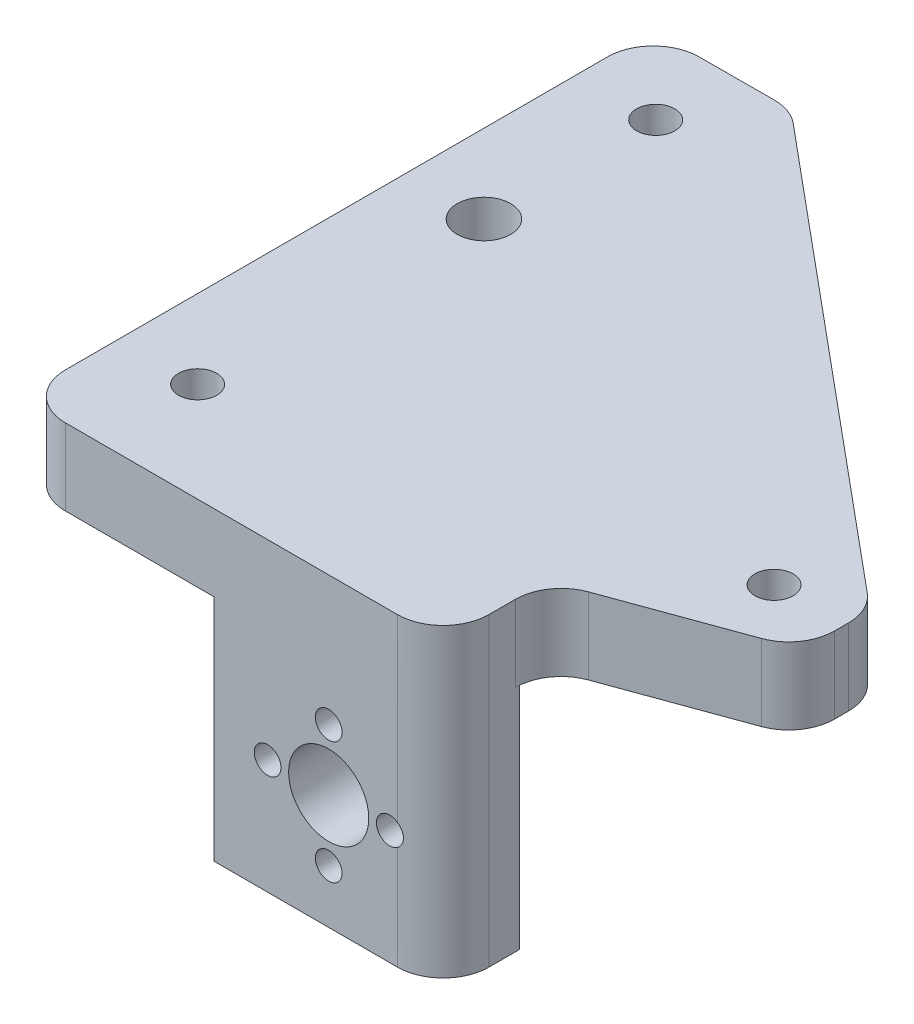
ISO-10303-21;
HEADER;
FILE_DESCRIPTION(('STEP AP214'),'2;1');
FILE_NAME('part.step','',(''),(''),'','','');
FILE_SCHEMA(('AUTOMOTIVE_DESIGN { 1 0 10303 214 1 1 1 1 }'));
ENDSEC;
DATA;
#1=APPLICATION_CONTEXT('core data for automotive mechanical design processes');
#2=APPLICATION_PROTOCOL_DEFINITION('international standard','automotive_design',2000,#1);
#3=PRODUCT_CONTEXT('',#1,'mechanical');
#4=PRODUCT('Part','Part','',(#3));
#5=PRODUCT_RELATED_PRODUCT_CATEGORY('part','',(#4));
#6=PRODUCT_DEFINITION_FORMATION('','',#4);
#7=PRODUCT_DEFINITION_CONTEXT('part definition',#1,'design');
#8=PRODUCT_DEFINITION('design','',#6,#7);
#9=PRODUCT_DEFINITION_SHAPE('','',#8);
#10=(LENGTH_UNIT() NAMED_UNIT(*) SI_UNIT(.MILLI.,.METRE.));
#11=(NAMED_UNIT(*) PLANE_ANGLE_UNIT() SI_UNIT($,.RADIAN.));
#12=(NAMED_UNIT(*) SI_UNIT($,.STERADIAN.) SOLID_ANGLE_UNIT());
#13=UNCERTAINTY_MEASURE_WITH_UNIT(LENGTH_MEASURE(1.E-05),#10,'distance_accuracy_value','');
#14=(GEOMETRIC_REPRESENTATION_CONTEXT(3) GLOBAL_UNCERTAINTY_ASSIGNED_CONTEXT((#13)) GLOBAL_UNIT_ASSIGNED_CONTEXT((#10,
#11,#12)) REPRESENTATION_CONTEXT('',''));
#15=CARTESIAN_POINT('',(0.,0.,0.));
#16=DIRECTION('',(0.,0.,1.));
#17=DIRECTION('',(1.,0.,0.));
#18=AXIS2_PLACEMENT_3D('',#15,#16,#17);
#19=CARTESIAN_POINT('',(25.5,10.,0.));
#20=DIRECTION('',(0.,0.,-1.));
#21=DIRECTION('',(-1.,0.,0.));
#22=AXIS2_PLACEMENT_3D('',#19,#20,#21);
#23=PLANE('',#22);
#24=CARTESIAN_POINT('',(32.5,-15.,0.));
#25=DIRECTION('',(0.,0.,1.));
#26=DIRECTION('',(1.,0.,0.));
#27=AXIS2_PLACEMENT_3D('',#24,#25,#26);
#28=CIRCLE('',#27,1.75);
#29=CARTESIAN_POINT('',(34.25,-15.,0.));
#30=VERTEX_POINT('',#29);
#31=EDGE_CURVE('E163',#30,#30,#28,.T.);
#32=ORIENTED_EDGE('',*,*,#31,.F.);
#33=EDGE_LOOP('',(#32));
#34=FACE_BOUND('',#33,.T.);
#35=CARTESIAN_POINT('',(40.5,-7.,0.));
#36=DIRECTION('',(0.,0.,-1.));
#37=DIRECTION('',(-1.,0.,0.));
#38=AXIS2_PLACEMENT_3D('',#35,#36,#37);
#39=CIRCLE('',#38,1.75);
#40=CARTESIAN_POINT('',(38.75,-7.,0.));
#41=VERTEX_POINT('',#40);
#42=EDGE_CURVE('E479',#41,#41,#39,.T.);
#43=ORIENTED_EDGE('',*,*,#42,.T.);
#44=EDGE_LOOP('',(#43));
#45=FACE_BOUND('',#44,.T.);
#46=CARTESIAN_POINT('',(40.5,-23.,0.));
#47=DIRECTION('',(0.,0.,1.));
#48=DIRECTION('',(1.,0.,0.));
#49=AXIS2_PLACEMENT_3D('',#46,#47,#48);
#50=CIRCLE('',#49,1.75);
#51=CARTESIAN_POINT('',(42.25,-23.,0.));
#52=VERTEX_POINT('',#51);
#53=EDGE_CURVE('E492',#52,#52,#50,.T.);
#54=ORIENTED_EDGE('',*,*,#53,.F.);
#55=EDGE_LOOP('',(#54));
#56=FACE_BOUND('',#55,.T.);
#57=DIRECTION('',(0.,-1.,0.));
#58=VECTOR('',#57,1.);
#59=CARTESIAN_POINT('',(49.5,10.,0.));
#60=LINE('',#59,#58);
#61=CARTESIAN_POINT('',(49.5,-16.4361406616345,0.));
#62=VERTEX_POINT('',#61);
#63=CARTESIAN_POINT('',(49.5,-30.,0.));
#64=VERTEX_POINT('',#63);
#65=EDGE_CURVE('E172',#62,#64,#60,.T.);
#66=ORIENTED_EDGE('',*,*,#65,.F.);
#67=CARTESIAN_POINT('',(48.5,-15.,0.));
#68=DIRECTION('',(0.,0.,-1.));
#69=DIRECTION('',(-1.,0.,0.));
#70=AXIS2_PLACEMENT_3D('',#67,#68,#69);
#71=CIRCLE('',#70,1.75);
#72=CARTESIAN_POINT('',(49.5,-13.5638593383655,0.));
#73=VERTEX_POINT('',#72);
#74=EDGE_CURVE('E48',#62,#73,#71,.T.);
#75=ORIENTED_EDGE('',*,*,#74,.T.);
#76=CARTESIAN_POINT('',(49.5,10.,0.));
#77=VERTEX_POINT('',#76);
#78=EDGE_CURVE('E169',#77,#73,#60,.T.);
#79=ORIENTED_EDGE('',*,*,#78,.F.);
#80=DIRECTION('',(1.,0.,0.));
#81=VECTOR('',#80,1.);
#82=CARTESIAN_POINT('',(6.00000000000004,10.,0.));
#83=LINE('',#82,#81);
#84=CARTESIAN_POINT('',(6.,10.,0.));
#85=VERTEX_POINT('',#84);
#86=EDGE_CURVE('E338',#85,#77,#83,.T.);
#87=ORIENTED_EDGE('',*,*,#86,.F.);
#88=DIRECTION('',(0.,-1.,0.));
#89=VECTOR('',#88,1.);
#90=CARTESIAN_POINT('',(6.,10.,0.));
#91=LINE('',#90,#89);
#92=CARTESIAN_POINT('',(6.,0.,0.));
#93=VERTEX_POINT('',#92);
#94=EDGE_CURVE('E179',#85,#93,#91,.T.);
#95=ORIENTED_EDGE('',*,*,#94,.T.);
#96=DIRECTION('',(1.,0.,0.));
#97=VECTOR('',#96,1.);
#98=CARTESIAN_POINT('',(25.5,0.,0.));
#99=LINE('',#98,#97);
#100=CARTESIAN_POINT('',(25.5,0.,0.));
#101=VERTEX_POINT('',#100);
#102=EDGE_CURVE('E252',#93,#101,#99,.T.);
#103=ORIENTED_EDGE('',*,*,#102,.T.);
#104=DIRECTION('',(0.,1.,0.));
#105=VECTOR('',#104,1.);
#106=CARTESIAN_POINT('',(25.5,-30.,0.));
#107=LINE('',#106,#105);
#108=CARTESIAN_POINT('',(25.5,-30.,0.));
#109=VERTEX_POINT('',#108);
#110=EDGE_CURVE('E56',#109,#101,#107,.T.);
#111=ORIENTED_EDGE('',*,*,#110,.F.);
#112=DIRECTION('',(1.,0.,0.));
#113=VECTOR('',#112,1.);
#114=CARTESIAN_POINT('',(74.,-30.,0.));
#115=LINE('',#114,#113);
#116=EDGE_CURVE('E281',#109,#64,#115,.T.);
#117=ORIENTED_EDGE('',*,*,#116,.T.);
#118=EDGE_LOOP('',(#66,#75,#79,#87,#95,#103,#111,#117));
#119=FACE_BOUND('',#118,.T.);
#120=CARTESIAN_POINT('',(40.5,-15.,0.));
#121=DIRECTION('',(0.,0.,-1.));
#122=DIRECTION('',(-1.,0.,0.));
#123=AXIS2_PLACEMENT_3D('',#120,#121,#122);
#124=CIRCLE('',#123,5.25);
#125=CARTESIAN_POINT('',(35.25,-15.,0.));
#126=VERTEX_POINT('',#125);
#127=EDGE_CURVE('E480',#126,#126,#124,.T.);
#128=ORIENTED_EDGE('',*,*,#127,.T.);
#129=EDGE_LOOP('',(#128));
#130=FACE_BOUND('',#129,.T.);
#131=ADVANCED_FACE('F33',(#34,#45,#56,#119,#130),#23,.F.);
#132=CARTESIAN_POINT('',(74.,-30.,-10.));
#133=DIRECTION('',(0.,0.,-1.));
#134=DIRECTION('',(-1.,0.,0.));
#135=AXIS2_PLACEMENT_3D('',#132,#133,#134);
#136=PLANE('',#135);
#137=CARTESIAN_POINT('',(32.5,-15.,-10.));
#138=DIRECTION('',(0.,0.,1.));
#139=DIRECTION('',(1.,0.,0.));
#140=AXIS2_PLACEMENT_3D('',#137,#138,#139);
#141=CIRCLE('',#140,1.75);
#142=CARTESIAN_POINT('',(34.25,-15.,-10.));
#143=VERTEX_POINT('',#142);
#144=EDGE_CURVE('E491',#143,#143,#141,.T.);
#145=ORIENTED_EDGE('',*,*,#144,.T.);
#146=EDGE_LOOP('',(#145));
#147=FACE_BOUND('',#146,.T.);
#148=CARTESIAN_POINT('',(40.5,-23.,-10.));
#149=DIRECTION('',(0.,0.,1.));
#150=DIRECTION('',(1.,0.,0.));
#151=AXIS2_PLACEMENT_3D('',#148,#149,#150);
#152=CIRCLE('',#151,1.75);
#153=CARTESIAN_POINT('',(42.25,-23.,-10.));
#154=VERTEX_POINT('',#153);
#155=EDGE_CURVE('E488',#154,#154,#152,.T.);
#156=ORIENTED_EDGE('',*,*,#155,.T.);
#157=EDGE_LOOP('',(#156));
#158=FACE_BOUND('',#157,.T.);
#159=DIRECTION('',(-1.,0.,0.));
#160=VECTOR('',#159,1.);
#161=CARTESIAN_POINT('',(74.,0.,-10.));
#162=LINE('',#161,#160);
#163=CARTESIAN_POINT('',(55.5,0.,-10.));
#164=VERTEX_POINT('',#163);
#165=CARTESIAN_POINT('',(25.5,0.,-10.));
#166=VERTEX_POINT('',#165);
#167=EDGE_CURVE('E282',#164,#166,#162,.T.);
#168=ORIENTED_EDGE('',*,*,#167,.F.);
#169=DIRECTION('',(0.,1.,0.));
#170=VECTOR('',#169,1.);
#171=CARTESIAN_POINT('',(55.5,-30.,-10.));
#172=LINE('',#171,#170);
#173=CARTESIAN_POINT('',(55.5,-30.,-10.));
#174=VERTEX_POINT('',#173);
#175=EDGE_CURVE('E289',#174,#164,#172,.T.);
#176=ORIENTED_EDGE('',*,*,#175,.F.);
#177=DIRECTION('',(-1.,0.,0.));
#178=VECTOR('',#177,1.);
#179=CARTESIAN_POINT('',(74.,-30.,-10.));
#180=LINE('',#179,#178);
#181=CARTESIAN_POINT('',(25.5,-30.,-10.));
#182=VERTEX_POINT('',#181);
#183=EDGE_CURVE('E288',#174,#182,#180,.T.);
#184=ORIENTED_EDGE('',*,*,#183,.T.);
#185=DIRECTION('',(0.,1.,0.));
#186=VECTOR('',#185,1.);
#187=CARTESIAN_POINT('',(25.5,-30.,-10.));
#188=LINE('',#187,#186);
#189=EDGE_CURVE('E291',#182,#166,#188,.T.);
#190=ORIENTED_EDGE('',*,*,#189,.T.);
#191=EDGE_LOOP('',(#168,#176,#184,#190));
#192=FACE_BOUND('',#191,.T.);
#193=CARTESIAN_POINT('',(48.5,-15.,-10.));
#194=DIRECTION('',(0.,0.,-1.));
#195=DIRECTION('',(-1.,0.,0.));
#196=AXIS2_PLACEMENT_3D('',#193,#194,#195);
#197=CIRCLE('',#196,1.75);
#198=CARTESIAN_POINT('',(46.75,-15.,-10.));
#199=VERTEX_POINT('',#198);
#200=EDGE_CURVE('E173',#199,#199,#197,.T.);
#201=ORIENTED_EDGE('',*,*,#200,.F.);
#202=EDGE_LOOP('',(#201));
#203=FACE_BOUND('',#202,.T.);
#204=CARTESIAN_POINT('',(40.5,-7.,-10.));
#205=DIRECTION('',(0.,0.,-1.));
#206=DIRECTION('',(-1.,0.,0.));
#207=AXIS2_PLACEMENT_3D('',#204,#205,#206);
#208=CIRCLE('',#207,1.75);
#209=CARTESIAN_POINT('',(38.75,-7.,-10.));
#210=VERTEX_POINT('',#209);
#211=EDGE_CURVE('E174',#210,#210,#208,.T.);
#212=ORIENTED_EDGE('',*,*,#211,.F.);
#213=EDGE_LOOP('',(#212));
#214=FACE_BOUND('',#213,.T.);
#215=CARTESIAN_POINT('',(40.5,-15.,-10.));
#216=DIRECTION('',(0.,0.,-1.));
#217=DIRECTION('',(-1.,0.,0.));
#218=AXIS2_PLACEMENT_3D('',#215,#216,#217);
#219=CIRCLE('',#218,5.25);
#220=CARTESIAN_POINT('',(35.25,-15.,-10.));
#221=VERTEX_POINT('',#220);
#222=EDGE_CURVE('E477',#221,#221,#219,.T.);
#223=ORIENTED_EDGE('',*,*,#222,.F.);
#224=EDGE_LOOP('',(#223));
#225=FACE_BOUND('',#224,.T.);
#226=ADVANCED_FACE('F361',(#147,#158,#192,#203,#214,#225),#136,.T.);
#227=CARTESIAN_POINT('',(74.,0.,-26.7674411784504));
#228=DIRECTION('',(0.,-1.,0.));
#229=DIRECTION('',(0.,0.,-1.));
#230=AXIS2_PLACEMENT_3D('',#227,#228,#229);
#231=PLANE('',#230);
#232=CARTESIAN_POINT('',(70.8,0.,-28.0365648973394));
#233=DIRECTION('',(0.,1.,0.));
#234=DIRECTION('',(0.,0.,1.));
#235=AXIS2_PLACEMENT_3D('',#232,#233,#234);
#236=CIRCLE('',#235,2.50000000000001);
#237=CARTESIAN_POINT('',(70.8,0.,-25.5365648973394));
#238=VERTEX_POINT('',#237);
#239=EDGE_CURVE('E306',#238,#238,#236,.T.);
#240=ORIENTED_EDGE('',*,*,#239,.T.);
#241=EDGE_LOOP('',(#240));
#242=FACE_BOUND('',#241,.T.);
#243=CARTESIAN_POINT('',(10.3,0.,-73.0365648973394));
#244=DIRECTION('',(0.,1.,0.));
#245=DIRECTION('',(0.,0.,1.));
#246=AXIS2_PLACEMENT_3D('',#243,#244,#245);
#247=CIRCLE('',#246,2.5);
#248=CARTESIAN_POINT('',(10.3,0.,-70.5365648973394));
#249=VERTEX_POINT('',#248);
#250=EDGE_CURVE('E232',#249,#249,#247,.T.);
#251=ORIENTED_EDGE('',*,*,#250,.T.);
#252=EDGE_LOOP('',(#251));
#253=FACE_BOUND('',#252,.T.);
#254=CARTESIAN_POINT('',(10.3,0.,-13.0365648973394));
#255=DIRECTION('',(0.,1.,0.));
#256=DIRECTION('',(0.,0.,1.));
#257=AXIS2_PLACEMENT_3D('',#254,#255,#256);
#258=CIRCLE('',#257,2.5);
#259=CARTESIAN_POINT('',(10.3,0.,-10.5365648973394));
#260=VERTEX_POINT('',#259);
#261=EDGE_CURVE('E312',#260,#260,#258,.T.);
#262=ORIENTED_EDGE('',*,*,#261,.T.);
#263=EDGE_LOOP('',(#262));
#264=FACE_BOUND('',#263,.T.);
#265=CARTESIAN_POINT('',(10.3,0.,-50.5365648973394));
#266=DIRECTION('',(0.,1.,0.));
#267=DIRECTION('',(0.,0.,1.));
#268=AXIS2_PLACEMENT_3D('',#265,#266,#267);
#269=CIRCLE('',#268,3.50000000000001);
#270=CARTESIAN_POINT('',(10.3,0.,-47.0365648973394));
#271=VERTEX_POINT('',#270);
#272=EDGE_CURVE('E302',#271,#271,#269,.T.);
#273=ORIENTED_EDGE('',*,*,#272,.T.);
#274=EDGE_LOOP('',(#273));
#275=FACE_BOUND('',#274,.T.);
#276=CARTESIAN_POINT('',(61.5,0.,-9.44767998041191));
#277=DIRECTION('',(0.,-1.,0.));
#278=DIRECTION('',(0.,0.,-1.));
#279=AXIS2_PLACEMENT_3D('',#276,#277,#278);
#280=CIRCLE('',#279,6.);
#281=CARTESIAN_POINT('',(55.5,0.,-9.44767998041187));
#282=VERTEX_POINT('',#281);
#283=CARTESIAN_POINT('',(59.447879140046,0.,-15.0858357051274));
#284=VERTEX_POINT('',#283);
#285=EDGE_CURVE('E255',#282,#284,#280,.T.);
#286=ORIENTED_EDGE('',*,*,#285,.F.);
#287=DIRECTION('',(0.,0.,-1.));
#288=VECTOR('',#287,1.);
#289=CARTESIAN_POINT('',(55.4999999999999,0.,-26.7674411784503));
#290=LINE('',#289,#288);
#291=EDGE_CURVE('E11',#282,#164,#290,.T.);
#292=ORIENTED_EDGE('',*,*,#291,.T.);
#293=ORIENTED_EDGE('',*,*,#167,.T.);
#294=DIRECTION('',(0.,0.,1.));
#295=VECTOR('',#294,1.);
#296=CARTESIAN_POINT('',(25.5,0.,-26.7674411784504));
#297=LINE('',#296,#295);
#298=EDGE_CURVE('E162',#166,#101,#297,.T.);
#299=ORIENTED_EDGE('',*,*,#298,.T.);
#300=ORIENTED_EDGE('',*,*,#102,.F.);
#301=CARTESIAN_POINT('',(6.,0.,-6.));
#302=DIRECTION('',(0.,1.,0.));
#303=DIRECTION('',(0.,0.,1.));
#304=AXIS2_PLACEMENT_3D('',#301,#302,#303);
#305=CIRCLE('',#304,6.);
#306=CARTESIAN_POINT('',(0.,0.,-6.00000000000004));
#307=VERTEX_POINT('',#306);
#308=EDGE_CURVE('E249',#307,#93,#305,.T.);
#309=ORIENTED_EDGE('',*,*,#308,.F.);
#310=DIRECTION('',(0.,0.,1.));
#311=VECTOR('',#310,1.);
#312=CARTESIAN_POINT('',(0.,0.,-6.00000000000004));
#313=LINE('',#312,#311);
#314=CARTESIAN_POINT('',(0.,0.,-77.0212988352063));
#315=VERTEX_POINT('',#314);
#316=EDGE_CURVE('E247',#315,#307,#313,.T.);
#317=ORIENTED_EDGE('',*,*,#316,.F.);
#318=CARTESIAN_POINT('',(6.,0.,-77.0212988352063));
#319=DIRECTION('',(0.,1.,0.));
#320=DIRECTION('',(0.,0.,-1.));
#321=AXIS2_PLACEMENT_3D('',#318,#319,#320);
#322=CIRCLE('',#321,6.);
#323=CARTESIAN_POINT('',(5.97866336166768,0.,-83.0212608974084));
#324=VERTEX_POINT('',#323);
#325=EDGE_CURVE('E245',#324,#315,#322,.T.);
#326=ORIENTED_EDGE('',*,*,#325,.F.);
#327=DIRECTION('',(-0.999993677033686,0.,0.0035561063887267));
#328=VECTOR('',#327,1.);
#329=CARTESIAN_POINT('',(5.97866336166768,0.,-83.0212608974084));
#330=LINE('',#329,#328);
#331=CARTESIAN_POINT('',(15.8160785892383,0.,-83.0562440137448));
#332=VERTEX_POINT('',#331);
#333=EDGE_CURVE('E243',#332,#324,#330,.T.);
#334=ORIENTED_EDGE('',*,*,#333,.F.);
#335=CARTESIAN_POINT('',(15.8374152275707,0.,-77.0562819515427));
#336=DIRECTION('',(0.,1.,0.));
#337=DIRECTION('',(0.,0.,-1.));
#338=AXIS2_PLACEMENT_3D('',#335,#336,#337);
#339=CIRCLE('',#338,6.);
#340=CARTESIAN_POINT('',(19.6777716865142,0.,-81.6662344749697));
#341=VERTEX_POINT('',#340);
#342=EDGE_CURVE('E241',#341,#332,#339,.T.);
#343=ORIENTED_EDGE('',*,*,#342,.F.);
#344=DIRECTION('',(-0.76832542057117,0.,-0.640059409823912));
#345=VECTOR('',#344,1.);
#346=CARTESIAN_POINT('',(19.6777716865142,0.,-81.6662344749697));
#347=LINE('',#346,#345);
#348=CARTESIAN_POINT('',(77.8403564589434,0.,-33.2134452185638));
#349=VERTEX_POINT('',#348);
#350=EDGE_CURVE('E239',#349,#341,#347,.T.);
#351=ORIENTED_EDGE('',*,*,#350,.F.);
#352=CARTESIAN_POINT('',(74.,0.,-28.6034926951367));
#353=DIRECTION('',(0.,1.,0.));
#354=DIRECTION('',(0.,0.,-1.));
#355=AXIS2_PLACEMENT_3D('',#352,#353,#354);
#356=CIRCLE('',#355,6.);
#357=CARTESIAN_POINT('',(80.,0.,-28.6034926951367));
#358=VERTEX_POINT('',#357);
#359=EDGE_CURVE('E229',#358,#349,#356,.T.);
#360=ORIENTED_EDGE('',*,*,#359,.F.);
#361=DIRECTION('',(0.,0.,-1.));
#362=VECTOR('',#361,1.);
#363=CARTESIAN_POINT('',(80.,0.,-28.6034926951367));
#364=LINE('',#363,#362);
#365=CARTESIAN_POINT('',(80.,0.,-26.7674411784504));
#366=VERTEX_POINT('',#365);
#367=EDGE_CURVE('E215',#366,#358,#364,.T.);
#368=ORIENTED_EDGE('',*,*,#367,.F.);
#369=CARTESIAN_POINT('',(74.,0.,-26.7674411784504));
#370=DIRECTION('',(0.,1.,0.));
#371=DIRECTION('',(0.,0.,-1.));
#372=AXIS2_PLACEMENT_3D('',#369,#370,#371);
#373=CIRCLE('',#372,6.00000000000002);
#374=CARTESIAN_POINT('',(76.052120859954,0.,-21.1292854537349));
#375=VERTEX_POINT('',#374);
#376=EDGE_CURVE('E222',#375,#366,#373,.T.);
#377=ORIENTED_EDGE('',*,*,#376,.F.);
#378=DIRECTION('',(0.939692620785909,0.,-0.342020143325667));
#379=VECTOR('',#378,1.);
#380=CARTESIAN_POINT('',(59.447879140046,0.,-15.0858357051274));
#381=LINE('',#380,#379);
#382=EDGE_CURVE('E257',#284,#375,#381,.T.);
#383=ORIENTED_EDGE('',*,*,#382,.F.);
#384=EDGE_LOOP('',(#286,#292,#293,#299,#300,#309,#317,#326,#334,#343,#351,#360,#368,#377,#383));
#385=FACE_BOUND('',#384,.T.);
#386=ADVANCED_FACE('F349',(#242,#253,#264,#275,#385),#231,.T.);
#387=CARTESIAN_POINT('',(74.,10.,-26.7674411784504));
#388=DIRECTION('',(0.,-1.,0.));
#389=DIRECTION('',(0.,0.,-1.));
#390=AXIS2_PLACEMENT_3D('',#387,#388,#389);
#391=PLANE('',#390);
#392=CARTESIAN_POINT('',(74.,10.,-26.7674411784504));
#393=DIRECTION('',(0.,1.,0.));
#394=DIRECTION('',(0.,0.,-1.));
#395=AXIS2_PLACEMENT_3D('',#392,#393,#394);
#396=CIRCLE('',#395,6.00000000000002);
#397=CARTESIAN_POINT('',(76.052120859954,10.,-21.1292854537349));
#398=VERTEX_POINT('',#397);
#399=CARTESIAN_POINT('',(80.,10.,-26.7674411784504));
#400=VERTEX_POINT('',#399);
#401=EDGE_CURVE('E259',#398,#400,#396,.T.);
#402=ORIENTED_EDGE('',*,*,#401,.T.);
#403=DIRECTION('',(0.,0.,-1.));
#404=VECTOR('',#403,1.);
#405=CARTESIAN_POINT('',(80.,10.,-28.6034926951367));
#406=LINE('',#405,#404);
#407=CARTESIAN_POINT('',(80.,10.,-28.6034926951367));
#408=VERTEX_POINT('',#407);
#409=EDGE_CURVE('E216',#400,#408,#406,.T.);
#410=ORIENTED_EDGE('',*,*,#409,.T.);
#411=CARTESIAN_POINT('',(74.,10.,-28.6034926951367));
#412=DIRECTION('',(0.,1.,0.));
#413=DIRECTION('',(0.,0.,-1.));
#414=AXIS2_PLACEMENT_3D('',#411,#412,#413);
#415=CIRCLE('',#414,6.);
#416=CARTESIAN_POINT('',(77.8403564589434,10.,-33.2134452185638));
#417=VERTEX_POINT('',#416);
#418=EDGE_CURVE('E324',#408,#417,#415,.T.);
#419=ORIENTED_EDGE('',*,*,#418,.T.);
#420=DIRECTION('',(-0.76832542057117,0.,-0.640059409823912));
#421=VECTOR('',#420,1.);
#422=CARTESIAN_POINT('',(19.6777716865142,10.,-81.6662344749697));
#423=LINE('',#422,#421);
#424=CARTESIAN_POINT('',(19.6777716865142,10.,-81.6662344749697));
#425=VERTEX_POINT('',#424);
#426=EDGE_CURVE('E326',#417,#425,#423,.T.);
#427=ORIENTED_EDGE('',*,*,#426,.T.);
#428=CARTESIAN_POINT('',(15.8374152275707,10.,-77.0562819515427));
#429=DIRECTION('',(0.,1.,0.));
#430=DIRECTION('',(0.,0.,-1.));
#431=AXIS2_PLACEMENT_3D('',#428,#429,#430);
#432=CIRCLE('',#431,6.);
#433=CARTESIAN_POINT('',(15.8160785892383,10.,-83.0562440137448));
#434=VERTEX_POINT('',#433);
#435=EDGE_CURVE('E328',#425,#434,#432,.T.);
#436=ORIENTED_EDGE('',*,*,#435,.T.);
#437=DIRECTION('',(-0.999993677033686,0.,0.0035561063887267));
#438=VECTOR('',#437,1.);
#439=CARTESIAN_POINT('',(5.97866336166768,10.,-83.0212608974084));
#440=LINE('',#439,#438);
#441=CARTESIAN_POINT('',(5.97866336166768,10.,-83.0212608974084));
#442=VERTEX_POINT('',#441);
#443=EDGE_CURVE('E330',#434,#442,#440,.T.);
#444=ORIENTED_EDGE('',*,*,#443,.T.);
#445=CARTESIAN_POINT('',(6.,10.,-77.0212988352063));
#446=DIRECTION('',(0.,1.,0.));
#447=DIRECTION('',(0.,0.,-1.));
#448=AXIS2_PLACEMENT_3D('',#445,#446,#447);
#449=CIRCLE('',#448,6.);
#450=CARTESIAN_POINT('',(0.,10.,-77.0212988352063));
#451=VERTEX_POINT('',#450);
#452=EDGE_CURVE('E332',#442,#451,#449,.T.);
#453=ORIENTED_EDGE('',*,*,#452,.T.);
#454=DIRECTION('',(0.,0.,1.));
#455=VECTOR('',#454,1.);
#456=CARTESIAN_POINT('',(0.,10.,-6.00000000000004));
#457=LINE('',#456,#455);
#458=CARTESIAN_POINT('',(0.,10.,-6.00000000000004));
#459=VERTEX_POINT('',#458);
#460=EDGE_CURVE('E334',#451,#459,#457,.T.);
#461=ORIENTED_EDGE('',*,*,#460,.T.);
#462=CARTESIAN_POINT('',(6.,10.,-6.));
#463=DIRECTION('',(0.,1.,0.));
#464=DIRECTION('',(0.,0.,1.));
#465=AXIS2_PLACEMENT_3D('',#462,#463,#464);
#466=CIRCLE('',#465,6.);
#467=EDGE_CURVE('E336',#459,#85,#466,.T.);
#468=ORIENTED_EDGE('',*,*,#467,.T.);
#469=ORIENTED_EDGE('',*,*,#86,.T.);
#470=CARTESIAN_POINT('',(49.5,10.,-6.));
#471=DIRECTION('',(0.,1.,0.));
#472=DIRECTION('',(0.,0.,1.));
#473=AXIS2_PLACEMENT_3D('',#470,#471,#472);
#474=CIRCLE('',#473,6.);
#475=CARTESIAN_POINT('',(55.5,10.,-6.));
#476=VERTEX_POINT('',#475);
#477=EDGE_CURVE('E178',#77,#476,#474,.T.);
#478=ORIENTED_EDGE('',*,*,#477,.T.);
#479=DIRECTION('',(0.,0.,-1.));
#480=VECTOR('',#479,1.);
#481=CARTESIAN_POINT('',(55.5,10.,-6.));
#482=LINE('',#481,#480);
#483=CARTESIAN_POINT('',(55.5,10.,-9.44767998041191));
#484=VERTEX_POINT('',#483);
#485=EDGE_CURVE('E276',#476,#484,#482,.T.);
#486=ORIENTED_EDGE('',*,*,#485,.T.);
#487=CARTESIAN_POINT('',(61.5,10.,-9.44767998041191));
#488=DIRECTION('',(0.,-1.,0.));
#489=DIRECTION('',(0.,0.,-1.));
#490=AXIS2_PLACEMENT_3D('',#487,#488,#489);
#491=CIRCLE('',#490,6.);
#492=CARTESIAN_POINT('',(59.447879140046,10.,-15.0858357051274));
#493=VERTEX_POINT('',#492);
#494=EDGE_CURVE('E341',#484,#493,#491,.T.);
#495=ORIENTED_EDGE('',*,*,#494,.T.);
#496=DIRECTION('',(0.939692620785909,0.,-0.342020143325667));
#497=VECTOR('',#496,1.);
#498=CARTESIAN_POINT('',(59.447879140046,10.,-15.0858357051274));
#499=LINE('',#498,#497);
#500=EDGE_CURVE('E235',#493,#398,#499,.T.);
#501=ORIENTED_EDGE('',*,*,#500,.T.);
#502=EDGE_LOOP('',(#402,#410,#419,#427,#436,#444,#453,#461,#468,#469,#478,#486,#495,#501));
#503=FACE_BOUND('',#502,.T.);
#504=CARTESIAN_POINT('',(10.3,10.,-73.0365648973394));
#505=DIRECTION('',(0.,1.,0.));
#506=DIRECTION('',(0.,0.,1.));
#507=AXIS2_PLACEMENT_3D('',#504,#505,#506);
#508=CIRCLE('',#507,2.5);
#509=CARTESIAN_POINT('',(10.3,10.,-70.5365648973394));
#510=VERTEX_POINT('',#509);
#511=EDGE_CURVE('E227',#510,#510,#508,.T.);
#512=ORIENTED_EDGE('',*,*,#511,.F.);
#513=EDGE_LOOP('',(#512));
#514=FACE_BOUND('',#513,.T.);
#515=CARTESIAN_POINT('',(10.3,10.,-13.0365648973394));
#516=DIRECTION('',(0.,1.,0.));
#517=DIRECTION('',(0.,0.,1.));
#518=AXIS2_PLACEMENT_3D('',#515,#516,#517);
#519=CIRCLE('',#518,2.5);
#520=CARTESIAN_POINT('',(10.3,10.,-10.5365648973394));
#521=VERTEX_POINT('',#520);
#522=EDGE_CURVE('E315',#521,#521,#519,.T.);
#523=ORIENTED_EDGE('',*,*,#522,.F.);
#524=EDGE_LOOP('',(#523));
#525=FACE_BOUND('',#524,.T.);
#526=CARTESIAN_POINT('',(70.8,10.,-28.0365648973394));
#527=DIRECTION('',(0.,1.,0.));
#528=DIRECTION('',(0.,0.,1.));
#529=AXIS2_PLACEMENT_3D('',#526,#527,#528);
#530=CIRCLE('',#529,2.50000000000001);
#531=CARTESIAN_POINT('',(70.8,10.,-25.5365648973394));
#532=VERTEX_POINT('',#531);
#533=EDGE_CURVE('E309',#532,#532,#530,.T.);
#534=ORIENTED_EDGE('',*,*,#533,.F.);
#535=EDGE_LOOP('',(#534));
#536=FACE_BOUND('',#535,.T.);
#537=CARTESIAN_POINT('',(10.3,10.,-50.5365648973394));
#538=DIRECTION('',(0.,1.,0.));
#539=DIRECTION('',(0.,0.,1.));
#540=AXIS2_PLACEMENT_3D('',#537,#538,#539);
#541=CIRCLE('',#540,3.50000000000001);
#542=CARTESIAN_POINT('',(10.3,10.,-47.0365648973394));
#543=VERTEX_POINT('',#542);
#544=EDGE_CURVE('E303',#543,#543,#541,.T.);
#545=ORIENTED_EDGE('',*,*,#544,.F.);
#546=EDGE_LOOP('',(#545));
#547=FACE_BOUND('',#546,.T.);
#548=ADVANCED_FACE('F345',(#503,#514,#525,#536,#547),#391,.F.);
#549=CARTESIAN_POINT('',(74.,10.,-26.7674411784504));
#550=DIRECTION('',(0.,-1.,0.));
#551=DIRECTION('',(0.,0.,-1.));
#552=AXIS2_PLACEMENT_3D('',#549,#550,#551);
#553=CYLINDRICAL_SURFACE('',#552,6.00000000000002);
#554=ORIENTED_EDGE('',*,*,#376,.T.);
#555=DIRECTION('',(0.,-1.,0.));
#556=VECTOR('',#555,1.);
#557=CARTESIAN_POINT('',(80.,10.,-26.7674411784504));
#558=LINE('',#557,#556);
#559=EDGE_CURVE('E37',#400,#366,#558,.T.);
#560=ORIENTED_EDGE('',*,*,#559,.F.);
#561=ORIENTED_EDGE('',*,*,#401,.F.);
#562=DIRECTION('',(0.,-1.,0.));
#563=VECTOR('',#562,1.);
#564=CARTESIAN_POINT('',(76.052120859954,10.,-21.1292854537349));
#565=LINE('',#564,#563);
#566=EDGE_CURVE('E224',#398,#375,#565,.T.);
#567=ORIENTED_EDGE('',*,*,#566,.T.);
#568=EDGE_LOOP('',(#554,#560,#561,#567));
#569=FACE_BOUND('',#568,.T.);
#570=ADVANCED_FACE('F35',(#569),#553,.T.);
#571=CARTESIAN_POINT('',(80.,10.,-28.6034926951367));
#572=DIRECTION('',(-1.,0.,0.));
#573=DIRECTION('',(0.,0.,1.));
#574=AXIS2_PLACEMENT_3D('',#571,#572,#573);
#575=PLANE('',#574);
#576=ORIENTED_EDGE('',*,*,#367,.T.);
#577=DIRECTION('',(0.,-1.,0.));
#578=VECTOR('',#577,1.);
#579=CARTESIAN_POINT('',(80.,10.,-28.6034926951367));
#580=LINE('',#579,#578);
#581=EDGE_CURVE('E204',#408,#358,#580,.T.);
#582=ORIENTED_EDGE('',*,*,#581,.F.);
#583=ORIENTED_EDGE('',*,*,#409,.F.);
#584=ORIENTED_EDGE('',*,*,#559,.T.);
#585=EDGE_LOOP('',(#576,#582,#583,#584));
#586=FACE_BOUND('',#585,.T.);
#587=ADVANCED_FACE('F214',(#586),#575,.F.);
#588=CARTESIAN_POINT('',(74.,10.,-28.6034926951367));
#589=DIRECTION('',(0.,-1.,0.));
#590=DIRECTION('',(0.,0.,-1.));
#591=AXIS2_PLACEMENT_3D('',#588,#589,#590);
#592=CYLINDRICAL_SURFACE('',#591,6.);
#593=ORIENTED_EDGE('',*,*,#359,.T.);
#594=DIRECTION('',(0.,-1.,0.));
#595=VECTOR('',#594,1.);
#596=CARTESIAN_POINT('',(77.8403564589434,10.,-33.2134452185638));
#597=LINE('',#596,#595);
#598=EDGE_CURVE('E202',#417,#349,#597,.T.);
#599=ORIENTED_EDGE('',*,*,#598,.F.);
#600=ORIENTED_EDGE('',*,*,#418,.F.);
#601=ORIENTED_EDGE('',*,*,#581,.T.);
#602=EDGE_LOOP('',(#593,#599,#600,#601));
#603=FACE_BOUND('',#602,.T.);
#604=ADVANCED_FACE('F397',(#603),#592,.T.);
#605=CARTESIAN_POINT('',(19.6777716865142,10.,-81.6662344749697));
#606=DIRECTION('',(-0.640059409823912,0.,0.76832542057117));
#607=DIRECTION('',(0.76832542057117,0.,0.640059409823912));
#608=AXIS2_PLACEMENT_3D('',#605,#606,#607);
#609=PLANE('',#608);
#610=ORIENTED_EDGE('',*,*,#350,.T.);
#611=DIRECTION('',(0.,-1.,0.));
#612=VECTOR('',#611,1.);
#613=CARTESIAN_POINT('',(19.6777716865142,10.,-81.6662344749697));
#614=LINE('',#613,#612);
#615=EDGE_CURVE('E199',#425,#341,#614,.T.);
#616=ORIENTED_EDGE('',*,*,#615,.F.);
#617=ORIENTED_EDGE('',*,*,#426,.F.);
#618=ORIENTED_EDGE('',*,*,#598,.T.);
#619=EDGE_LOOP('',(#610,#616,#617,#618));
#620=FACE_BOUND('',#619,.T.);
#621=ADVANCED_FACE('F393',(#620),#609,.F.);
#622=CARTESIAN_POINT('',(15.8374152275707,10.,-77.0562819515427));
#623=DIRECTION('',(0.,-1.,0.));
#624=DIRECTION('',(0.,0.,-1.));
#625=AXIS2_PLACEMENT_3D('',#622,#623,#624);
#626=CYLINDRICAL_SURFACE('',#625,6.);
#627=ORIENTED_EDGE('',*,*,#342,.T.);
#628=DIRECTION('',(0.,-1.,0.));
#629=VECTOR('',#628,1.);
#630=CARTESIAN_POINT('',(15.8160785892383,10.,-83.0562440137448));
#631=LINE('',#630,#629);
#632=EDGE_CURVE('E196',#434,#332,#631,.T.);
#633=ORIENTED_EDGE('',*,*,#632,.F.);
#634=ORIENTED_EDGE('',*,*,#435,.F.);
#635=ORIENTED_EDGE('',*,*,#615,.T.);
#636=EDGE_LOOP('',(#627,#633,#634,#635));
#637=FACE_BOUND('',#636,.T.);
#638=ADVANCED_FACE('F389',(#637),#626,.T.);
#639=CARTESIAN_POINT('',(5.97866336166768,10.,-83.0212608974084));
#640=DIRECTION('',(0.0035561063887267,0.,0.999993677033686));
#641=DIRECTION('',(0.999993677033686,0.,-0.0035561063887267));
#642=AXIS2_PLACEMENT_3D('',#639,#640,#641);
#643=PLANE('',#642);
#644=ORIENTED_EDGE('',*,*,#333,.T.);
#645=DIRECTION('',(0.,-1.,0.));
#646=VECTOR('',#645,1.);
#647=CARTESIAN_POINT('',(5.97866336166768,10.,-83.0212608974084));
#648=LINE('',#647,#646);
#649=EDGE_CURVE('E193',#442,#324,#648,.T.);
#650=ORIENTED_EDGE('',*,*,#649,.F.);
#651=ORIENTED_EDGE('',*,*,#443,.F.);
#652=ORIENTED_EDGE('',*,*,#632,.T.);
#653=EDGE_LOOP('',(#644,#650,#651,#652));
#654=FACE_BOUND('',#653,.T.);
#655=ADVANCED_FACE('F385',(#654),#643,.F.);
#656=CARTESIAN_POINT('',(6.,10.,-77.0212988352063));
#657=DIRECTION('',(0.,-1.,0.));
#658=DIRECTION('',(0.,0.,-1.));
#659=AXIS2_PLACEMENT_3D('',#656,#657,#658);
#660=CYLINDRICAL_SURFACE('',#659,6.);
#661=ORIENTED_EDGE('',*,*,#325,.T.);
#662=DIRECTION('',(0.,-1.,0.));
#663=VECTOR('',#662,1.);
#664=CARTESIAN_POINT('',(0.,10.,-77.0212988352063));
#665=LINE('',#664,#663);
#666=EDGE_CURVE('E190',#451,#315,#665,.T.);
#667=ORIENTED_EDGE('',*,*,#666,.F.);
#668=ORIENTED_EDGE('',*,*,#452,.F.);
#669=ORIENTED_EDGE('',*,*,#649,.T.);
#670=EDGE_LOOP('',(#661,#667,#668,#669));
#671=FACE_BOUND('',#670,.T.);
#672=ADVANCED_FACE('F381',(#671),#660,.T.);
#673=CARTESIAN_POINT('',(0.,10.,-6.00000000000004));
#674=DIRECTION('',(1.,0.,0.));
#675=DIRECTION('',(0.,0.,-1.));
#676=AXIS2_PLACEMENT_3D('',#673,#674,#675);
#677=PLANE('',#676);
#678=ORIENTED_EDGE('',*,*,#316,.T.);
#679=DIRECTION('',(0.,-1.,0.));
#680=VECTOR('',#679,1.);
#681=CARTESIAN_POINT('',(0.,10.,-6.00000000000004));
#682=LINE('',#681,#680);
#683=EDGE_CURVE('E182',#459,#307,#682,.T.);
#684=ORIENTED_EDGE('',*,*,#683,.F.);
#685=ORIENTED_EDGE('',*,*,#460,.F.);
#686=ORIENTED_EDGE('',*,*,#666,.T.);
#687=EDGE_LOOP('',(#678,#684,#685,#686));
#688=FACE_BOUND('',#687,.T.);
#689=ADVANCED_FACE('F377',(#688),#677,.F.);
#690=CARTESIAN_POINT('',(6.,10.,-6.));
#691=DIRECTION('',(0.,-1.,0.));
#692=DIRECTION('',(0.,0.,-1.));
#693=AXIS2_PLACEMENT_3D('',#690,#691,#692);
#694=CYLINDRICAL_SURFACE('',#693,6.);
#695=ORIENTED_EDGE('',*,*,#308,.T.);
#696=ORIENTED_EDGE('',*,*,#94,.F.);
#697=ORIENTED_EDGE('',*,*,#467,.F.);
#698=ORIENTED_EDGE('',*,*,#683,.T.);
#699=EDGE_LOOP('',(#695,#696,#697,#698));
#700=FACE_BOUND('',#699,.T.);
#701=ADVANCED_FACE('F374',(#700),#694,.T.);
#702=CARTESIAN_POINT('',(49.5,10.,-6.));
#703=DIRECTION('',(0.,-1.,0.));
#704=DIRECTION('',(0.,0.,-1.));
#705=AXIS2_PLACEMENT_3D('',#702,#703,#704);
#706=CYLINDRICAL_SURFACE('',#705,6.);
#707=ORIENTED_EDGE('',*,*,#78,.T.);
#708=CARTESIAN_POINT('',(49.5,-13.5638593383655,0.));
#709=CARTESIAN_POINT('',(49.5402919208754,-13.5919149431768,1.04603440939395E-06));
#710=CARTESIAN_POINT('',(49.5793812131867,-13.6216525568021,-0.000405997131476574));
#711=CARTESIAN_POINT('',(49.6549128587823,-13.6842928781618,-0.00188145877586609));
#712=CARTESIAN_POINT('',(49.6913556072748,-13.7171951116111,-0.00294977827818688));
#713=CARTESIAN_POINT('',(49.7962483252331,-13.8202450652293,-0.00691016894298845));
#714=CARTESIAN_POINT('',(49.8604035142584,-13.8948342806849,-0.0105587401428812));
#715=CARTESIAN_POINT('',(49.9752968894177,-14.0536289237373,-0.0185764273074722));
#716=CARTESIAN_POINT('',(50.0260336852549,-14.137835346492,-0.0229456178603787));
#717=CARTESIAN_POINT('',(50.1127287641872,-14.3135619646191,-0.0312090758388113));
#718=CARTESIAN_POINT('',(50.1486892152459,-14.4050810847281,-0.0351034128751395));
#719=CARTESIAN_POINT('',(50.2049394746092,-14.5933327578399,-0.0414872816045746));
#720=CARTESIAN_POINT('',(50.2251550521302,-14.6900877336737,-0.0439701440993775));
#721=CARTESIAN_POINT('',(50.249037170316,-14.8856618670253,-0.0469258886177698));
#722=CARTESIAN_POINT('',(50.2527022643035,-14.9844812042306,-0.047398594933447));
#723=CARTESIAN_POINT('',(50.243403394725,-15.1805816205591,-0.0462305100838353));
#724=CARTESIAN_POINT('',(50.2305626955353,-15.2778686732584,-0.0446053850280876));
#725=CARTESIAN_POINT('',(50.1888440564453,-15.4688959914789,-0.0396367928197832));
#726=CARTESIAN_POINT('',(50.1599657214774,-15.5626361695663,-0.036293283337072));
#727=CARTESIAN_POINT('',(50.0869403611939,-15.7441158865299,-0.0286648148227841));
#728=CARTESIAN_POINT('',(50.0427653620489,-15.8318440764008,-0.0243781362404103));
#729=CARTESIAN_POINT('',(49.9403833778434,-15.9986814226558,-0.0159639018662615));
#730=CARTESIAN_POINT('',(49.8821823215119,-16.0777942002628,-0.0118362796950864));
#731=CARTESIAN_POINT('',(49.7708803177922,-16.2051774711888,-0.00593433110769437));
#732=CARTESIAN_POINT('',(49.7206766792527,-16.2559937812048,-0.00382537603294214));
#733=CARTESIAN_POINT('',(49.614492141299,-16.3511093157509,-0.000856294110584693));
#734=CARTESIAN_POINT('',(49.5585168728854,-16.3954147919926,5.03784033200653E-06));
#735=CARTESIAN_POINT('',(49.5,-16.4361406616345,0.));
#736=B_SPLINE_CURVE_WITH_KNOTS('',3,(#708,#709,#710,#711,#712,#713,#714,#715,#716,#717,#718,
#719,#720,#721,#722,#723,#724,#725,#726,#727,#728,#729,#730,#731,#732,#733,#734,#735),
.UNSPECIFIED.,.F.,.F.,(4,2,2,2,2,2,2,2,2,2,2,2,2,4),(0.,0.147197181976345,0.294372337618625,
0.588214348375887,0.882086792564203,1.17591610481264,1.4711224574371,1.7663546135421,
2.05939474778521,2.35244210103506,2.64602822094139,2.93949046077497,3.15336792215887,
3.36703865708411),.UNSPECIFIED.);
#737=EDGE_CURVE('E157',#73,#62,#736,.T.);
#738=ORIENTED_EDGE('',*,*,#737,.T.);
#739=ORIENTED_EDGE('',*,*,#65,.T.);
#740=CARTESIAN_POINT('',(49.5,-30.,-6.));
#741=DIRECTION('',(0.,-1.,0.));
#742=DIRECTION('',(0.,0.,-1.));
#743=AXIS2_PLACEMENT_3D('',#740,#741,#742);
#744=CIRCLE('',#743,6.);
#745=CARTESIAN_POINT('',(55.5,-30.,-6.00000000000004));
#746=VERTEX_POINT('',#745);
#747=EDGE_CURVE('E278',#746,#64,#744,.T.);
#748=ORIENTED_EDGE('',*,*,#747,.F.);
#749=DIRECTION('',(0.,-1.,0.));
#750=VECTOR('',#749,1.);
#751=CARTESIAN_POINT('',(55.5,10.,-6.));
#752=LINE('',#751,#750);
#753=EDGE_CURVE('E184',#476,#746,#752,.T.);
#754=ORIENTED_EDGE('',*,*,#753,.F.);
#755=ORIENTED_EDGE('',*,*,#477,.F.);
#756=EDGE_LOOP('',(#707,#738,#739,#748,#754,#755));
#757=FACE_BOUND('',#756,.T.);
#758=ADVANCED_FACE('F176',(#757),#706,.T.);
#759=CARTESIAN_POINT('',(55.5,10.,-6.));
#760=DIRECTION('',(-1.,0.,0.));
#761=DIRECTION('',(0.,0.,1.));
#762=AXIS2_PLACEMENT_3D('',#759,#760,#761);
#763=PLANE('',#762);
#764=ORIENTED_EDGE('',*,*,#753,.T.);
#765=DIRECTION('',(0.,0.,-1.));
#766=VECTOR('',#765,1.);
#767=CARTESIAN_POINT('',(55.4999999999999,-30.,-26.7674411784503));
#768=LINE('',#767,#766);
#769=EDGE_CURVE('E275',#746,#174,#768,.T.);
#770=ORIENTED_EDGE('',*,*,#769,.T.);
#771=ORIENTED_EDGE('',*,*,#175,.T.);
#772=ORIENTED_EDGE('',*,*,#291,.F.);
#773=DIRECTION('',(0.,-1.,0.));
#774=VECTOR('',#773,1.);
#775=CARTESIAN_POINT('',(55.5,10.,-9.44767998041191));
#776=LINE('',#775,#774);
#777=EDGE_CURVE('E263',#484,#282,#776,.T.);
#778=ORIENTED_EDGE('',*,*,#777,.F.);
#779=ORIENTED_EDGE('',*,*,#485,.F.);
#780=EDGE_LOOP('',(#764,#770,#771,#772,#778,#779));
#781=FACE_BOUND('',#780,.T.);
#782=ADVANCED_FACE('F273',(#781),#763,.F.);
#783=CARTESIAN_POINT('',(61.5,10.,-9.44767998041191));
#784=DIRECTION('',(0.,-1.,0.));
#785=DIRECTION('',(0.,0.,-1.));
#786=AXIS2_PLACEMENT_3D('',#783,#784,#785);
#787=CYLINDRICAL_SURFACE('',#786,6.);
#788=ORIENTED_EDGE('',*,*,#285,.T.);
#789=DIRECTION('',(0.,-1.,0.));
#790=VECTOR('',#789,1.);
#791=CARTESIAN_POINT('',(59.447879140046,10.,-15.0858357051274));
#792=LINE('',#791,#790);
#793=EDGE_CURVE('E261',#493,#284,#792,.T.);
#794=ORIENTED_EDGE('',*,*,#793,.F.);
#795=ORIENTED_EDGE('',*,*,#494,.F.);
#796=ORIENTED_EDGE('',*,*,#777,.T.);
#797=EDGE_LOOP('',(#788,#794,#795,#796));
#798=FACE_BOUND('',#797,.T.);
#799=ADVANCED_FACE('F350',(#798),#787,.F.);
#800=CARTESIAN_POINT('',(59.447879140046,10.,-15.0858357051274));
#801=DIRECTION('',(-0.342020143325667,0.,-0.939692620785909));
#802=DIRECTION('',(-0.939692620785909,0.,0.342020143325667));
#803=AXIS2_PLACEMENT_3D('',#800,#801,#802);
#804=PLANE('',#803);
#805=ORIENTED_EDGE('',*,*,#382,.T.);
#806=ORIENTED_EDGE('',*,*,#566,.F.);
#807=ORIENTED_EDGE('',*,*,#500,.F.);
#808=ORIENTED_EDGE('',*,*,#793,.T.);
#809=EDGE_LOOP('',(#805,#806,#807,#808));
#810=FACE_BOUND('',#809,.T.);
#811=ADVANCED_FACE('F348',(#810),#804,.F.);
#812=CARTESIAN_POINT('',(10.3,10.,-73.0365648973394));
#813=DIRECTION('',(0.,-1.,0.));
#814=DIRECTION('',(0.,0.,-1.));
#815=AXIS2_PLACEMENT_3D('',#812,#813,#814);
#816=CYLINDRICAL_SURFACE('',#815,2.5);
#817=ORIENTED_EDGE('',*,*,#511,.T.);
#818=EDGE_LOOP('',(#817));
#819=FACE_BOUND('',#818,.T.);
#820=ORIENTED_EDGE('',*,*,#250,.F.);
#821=EDGE_LOOP('',(#820));
#822=FACE_BOUND('',#821,.T.);
#823=ADVANCED_FACE('F357',(#819,#822),#816,.F.);
#824=CARTESIAN_POINT('',(10.3,10.,-13.0365648973394));
#825=DIRECTION('',(0.,-1.,0.));
#826=DIRECTION('',(0.,0.,-1.));
#827=AXIS2_PLACEMENT_3D('',#824,#825,#826);
#828=CYLINDRICAL_SURFACE('',#827,2.5);
#829=ORIENTED_EDGE('',*,*,#522,.T.);
#830=EDGE_LOOP('',(#829));
#831=FACE_BOUND('',#830,.T.);
#832=ORIENTED_EDGE('',*,*,#261,.F.);
#833=EDGE_LOOP('',(#832));
#834=FACE_BOUND('',#833,.T.);
#835=ADVANCED_FACE('F416',(#831,#834),#828,.F.);
#836=CARTESIAN_POINT('',(70.8,10.,-28.0365648973394));
#837=DIRECTION('',(0.,-1.,0.));
#838=DIRECTION('',(0.,0.,-1.));
#839=AXIS2_PLACEMENT_3D('',#836,#837,#838);
#840=CYLINDRICAL_SURFACE('',#839,2.50000000000001);
#841=ORIENTED_EDGE('',*,*,#533,.T.);
#842=EDGE_LOOP('',(#841));
#843=FACE_BOUND('',#842,.T.);
#844=ORIENTED_EDGE('',*,*,#239,.F.);
#845=EDGE_LOOP('',(#844));
#846=FACE_BOUND('',#845,.T.);
#847=ADVANCED_FACE('F420',(#843,#846),#840,.F.);
#848=CARTESIAN_POINT('',(10.3,10.,-50.5365648973394));
#849=DIRECTION('',(0.,-1.,0.));
#850=DIRECTION('',(0.,0.,-1.));
#851=AXIS2_PLACEMENT_3D('',#848,#849,#850);
#852=CYLINDRICAL_SURFACE('',#851,3.50000000000001);
#853=ORIENTED_EDGE('',*,*,#544,.T.);
#854=EDGE_LOOP('',(#853));
#855=FACE_BOUND('',#854,.T.);
#856=ORIENTED_EDGE('',*,*,#272,.F.);
#857=EDGE_LOOP('',(#856));
#858=FACE_BOUND('',#857,.T.);
#859=ADVANCED_FACE('F424',(#855,#858),#852,.F.);
#860=CARTESIAN_POINT('',(25.5,-30.,-26.7674411784504));
#861=DIRECTION('',(-1.,0.,0.));
#862=DIRECTION('',(0.,0.,1.));
#863=AXIS2_PLACEMENT_3D('',#860,#861,#862);
#864=PLANE('',#863);
#865=ORIENTED_EDGE('',*,*,#298,.F.);
#866=ORIENTED_EDGE('',*,*,#189,.F.);
#867=DIRECTION('',(0.,0.,1.));
#868=VECTOR('',#867,1.);
#869=CARTESIAN_POINT('',(25.5,-30.,-26.7674411784504));
#870=LINE('',#869,#868);
#871=EDGE_CURVE('E293',#182,#109,#870,.T.);
#872=ORIENTED_EDGE('',*,*,#871,.T.);
#873=ORIENTED_EDGE('',*,*,#110,.T.);
#874=EDGE_LOOP('',(#865,#866,#872,#873));
#875=FACE_BOUND('',#874,.T.);
#876=ADVANCED_FACE('F428',(#875),#864,.T.);
#877=CARTESIAN_POINT('',(49.5,-30.,-6.));
#878=DIRECTION('',(0.,-1.,0.));
#879=DIRECTION('',(0.,0.,-1.));
#880=AXIS2_PLACEMENT_3D('',#877,#878,#879);
#881=PLANE('',#880);
#882=ORIENTED_EDGE('',*,*,#747,.T.);
#883=ORIENTED_EDGE('',*,*,#116,.F.);
#884=ORIENTED_EDGE('',*,*,#871,.F.);
#885=ORIENTED_EDGE('',*,*,#183,.F.);
#886=ORIENTED_EDGE('',*,*,#769,.F.);
#887=EDGE_LOOP('',(#882,#883,#884,#885,#886));
#888=FACE_BOUND('',#887,.T.);
#889=ADVANCED_FACE('F285',(#888),#881,.T.);
#890=CARTESIAN_POINT('',(40.5,-23.,0.));
#891=DIRECTION('',(0.,0.,-1.));
#892=DIRECTION('',(-1.,0.,0.));
#893=AXIS2_PLACEMENT_3D('',#890,#891,#892);
#894=CYLINDRICAL_SURFACE('',#893,1.75);
#895=ORIENTED_EDGE('',*,*,#53,.T.);
#896=EDGE_LOOP('',(#895));
#897=FACE_BOUND('',#896,.T.);
#898=ORIENTED_EDGE('',*,*,#155,.F.);
#899=EDGE_LOOP('',(#898));
#900=FACE_BOUND('',#899,.T.);
#901=ADVANCED_FACE('F434',(#897,#900),#894,.F.);
#902=CARTESIAN_POINT('',(48.5,-15.,0.));
#903=DIRECTION('',(0.,0.,-1.));
#904=DIRECTION('',(-1.,0.,0.));
#905=AXIS2_PLACEMENT_3D('',#902,#903,#904);
#906=CYLINDRICAL_SURFACE('',#905,1.75);
#907=ORIENTED_EDGE('',*,*,#200,.T.);
#908=EDGE_LOOP('',(#907));
#909=FACE_BOUND('',#908,.T.);
#910=ORIENTED_EDGE('',*,*,#74,.F.);
#911=ORIENTED_EDGE('',*,*,#737,.F.);
#912=EDGE_LOOP('',(#910,#911));
#913=FACE_BOUND('',#912,.T.);
#914=ADVANCED_FACE('F158',(#909,#913),#906,.F.);
#915=CARTESIAN_POINT('',(40.5,-7.,0.));
#916=DIRECTION('',(0.,0.,-1.));
#917=DIRECTION('',(-1.,0.,0.));
#918=AXIS2_PLACEMENT_3D('',#915,#916,#917);
#919=CYLINDRICAL_SURFACE('',#918,1.75);
#920=ORIENTED_EDGE('',*,*,#42,.F.);
#921=EDGE_LOOP('',(#920));
#922=FACE_BOUND('',#921,.T.);
#923=ORIENTED_EDGE('',*,*,#211,.T.);
#924=EDGE_LOOP('',(#923));
#925=FACE_BOUND('',#924,.T.);
#926=ADVANCED_FACE('F438',(#922,#925),#919,.F.);
#927=CARTESIAN_POINT('',(40.5,-15.,0.));
#928=DIRECTION('',(0.,0.,-1.));
#929=DIRECTION('',(-1.,0.,0.));
#930=AXIS2_PLACEMENT_3D('',#927,#928,#929);
#931=CYLINDRICAL_SURFACE('',#930,5.25);
#932=ORIENTED_EDGE('',*,*,#127,.F.);
#933=EDGE_LOOP('',(#932));
#934=FACE_BOUND('',#933,.T.);
#935=ORIENTED_EDGE('',*,*,#222,.T.);
#936=EDGE_LOOP('',(#935));
#937=FACE_BOUND('',#936,.T.);
#938=ADVANCED_FACE('F516',(#934,#937),#931,.F.);
#939=CARTESIAN_POINT('',(32.5,-15.,0.));
#940=DIRECTION('',(0.,0.,-1.));
#941=DIRECTION('',(-1.,0.,0.));
#942=AXIS2_PLACEMENT_3D('',#939,#940,#941);
#943=CYLINDRICAL_SURFACE('',#942,1.75);
#944=ORIENTED_EDGE('',*,*,#31,.T.);
#945=EDGE_LOOP('',(#944));
#946=FACE_BOUND('',#945,.T.);
#947=ORIENTED_EDGE('',*,*,#144,.F.);
#948=EDGE_LOOP('',(#947));
#949=FACE_BOUND('',#948,.T.);
#950=ADVANCED_FACE('F524',(#946,#949),#943,.F.);
#951=CLOSED_SHELL('',(#131,#226,#386,#548,#570,#587,#604,#621,#638,#655,#672,#689,#701,#758,
#782,#799,#811,#823,#835,#847,#859,#876,#889,#901,#914,#926,#938,#950));
#952=MANIFOLD_SOLID_BREP('B2',#951);
#953=ADVANCED_BREP_SHAPE_REPRESENTATION('',(#18,#952),#14);
#954=SHAPE_DEFINITION_REPRESENTATION(#9,#953);
ENDSEC;
END-ISO-10303-21;
